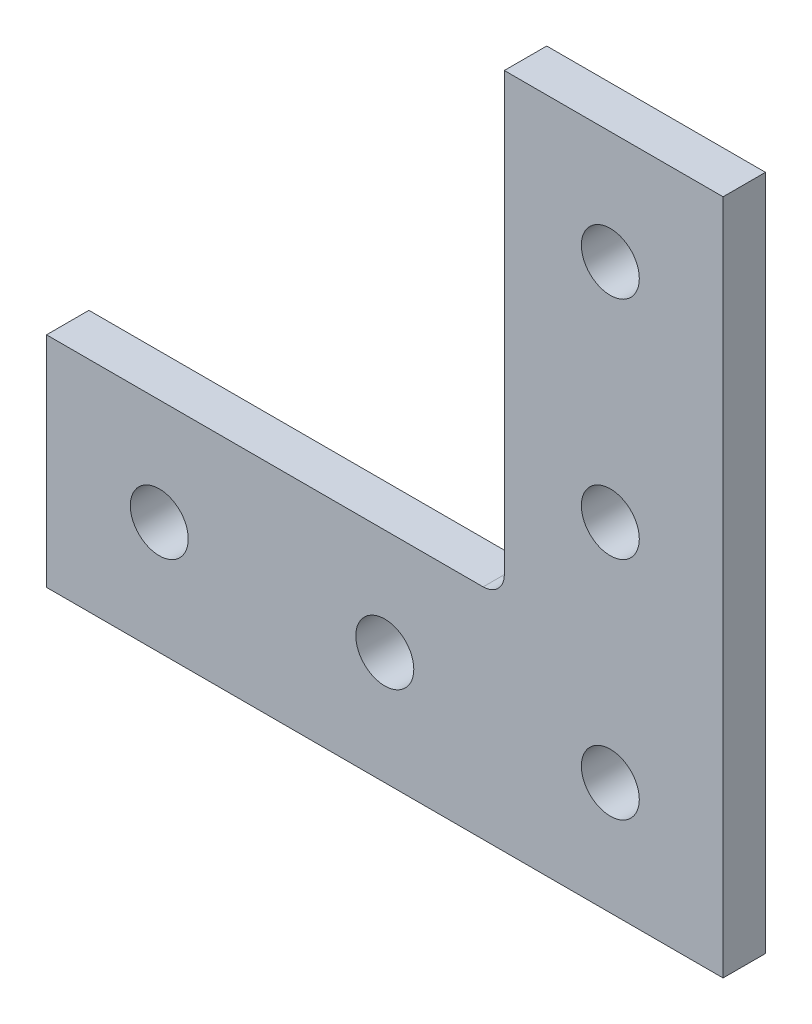
ISO-10303-21;
HEADER;
FILE_DESCRIPTION(('STEP AP214'),'2;1');
FILE_NAME('part.step','',(''),(''),'','','');
FILE_SCHEMA(('AUTOMOTIVE_DESIGN { 1 0 10303 214 1 1 1 1 }'));
ENDSEC;
DATA;
#1=APPLICATION_CONTEXT('core data for automotive mechanical design processes');
#2=APPLICATION_PROTOCOL_DEFINITION('international standard','automotive_design',2000,#1);
#3=PRODUCT_CONTEXT('',#1,'mechanical');
#4=PRODUCT('Part','Part','',(#3));
#5=PRODUCT_RELATED_PRODUCT_CATEGORY('part','',(#4));
#6=PRODUCT_DEFINITION_FORMATION('','',#4);
#7=PRODUCT_DEFINITION_CONTEXT('part definition',#1,'design');
#8=PRODUCT_DEFINITION('design','',#6,#7);
#9=PRODUCT_DEFINITION_SHAPE('','',#8);
#10=(LENGTH_UNIT() NAMED_UNIT(*) SI_UNIT(.MILLI.,.METRE.));
#11=(NAMED_UNIT(*) PLANE_ANGLE_UNIT() SI_UNIT($,.RADIAN.));
#12=(NAMED_UNIT(*) SI_UNIT($,.STERADIAN.) SOLID_ANGLE_UNIT());
#13=UNCERTAINTY_MEASURE_WITH_UNIT(LENGTH_MEASURE(1.E-05),#10,'distance_accuracy_value','');
#14=(GEOMETRIC_REPRESENTATION_CONTEXT(3) GLOBAL_UNCERTAINTY_ASSIGNED_CONTEXT((#13)) GLOBAL_UNIT_ASSIGNED_CONTEXT((#10,
#11,#12)) REPRESENTATION_CONTEXT('',''));
#15=CARTESIAN_POINT('',(0.,0.,0.));
#16=DIRECTION('',(0.,0.,1.));
#17=DIRECTION('',(1.,0.,0.));
#18=AXIS2_PLACEMENT_3D('',#15,#16,#17);
#19=CARTESIAN_POINT('',(-27.0256,27.0256,4.7752));
#20=DIRECTION('',(0.,0.,-1.));
#21=DIRECTION('',(-1.,0.,0.));
#22=AXIS2_PLACEMENT_3D('',#19,#20,#21);
#23=PLANE('',#22);
#24=CARTESIAN_POINT('',(-38.1,12.7,4.7752));
#25=DIRECTION('',(0.,0.,1.));
#26=DIRECTION('',(1.,0.,0.));
#27=AXIS2_PLACEMENT_3D('',#24,#25,#26);
#28=CIRCLE('',#27,3.2639);
#29=CARTESIAN_POINT('',(-34.8361,12.7,4.7752));
#30=VERTEX_POINT('',#29);
#31=EDGE_CURVE('E176',#30,#30,#28,.T.);
#32=ORIENTED_EDGE('',*,*,#31,.F.);
#33=EDGE_LOOP('',(#32));
#34=FACE_BOUND('',#33,.T.);
#35=CARTESIAN_POINT('',(-12.7,63.5,4.7752));
#36=DIRECTION('',(0.,0.,1.));
#37=DIRECTION('',(1.,0.,0.));
#38=AXIS2_PLACEMENT_3D('',#35,#36,#37);
#39=CIRCLE('',#38,3.2639);
#40=CARTESIAN_POINT('',(-9.4361,63.5,4.7752));
#41=VERTEX_POINT('',#40);
#42=EDGE_CURVE('E164',#41,#41,#39,.T.);
#43=ORIENTED_EDGE('',*,*,#42,.F.);
#44=EDGE_LOOP('',(#43));
#45=FACE_BOUND('',#44,.T.);
#46=DIRECTION('',(0.,-1.,0.));
#47=VECTOR('',#46,1.);
#48=CARTESIAN_POINT('',(-76.2,24.638,4.7752));
#49=LINE('',#48,#47);
#50=CARTESIAN_POINT('',(-76.2,24.638,4.7752));
#51=VERTEX_POINT('',#50);
#52=CARTESIAN_POINT('',(-76.2,0.,4.7752));
#53=VERTEX_POINT('',#52);
#54=EDGE_CURVE('E137',#51,#53,#49,.T.);
#55=ORIENTED_EDGE('',*,*,#54,.T.);
#56=DIRECTION('',(1.,0.,0.));
#57=VECTOR('',#56,1.);
#58=CARTESIAN_POINT('',(-76.2,0.,4.7752));
#59=LINE('',#58,#57);
#60=CARTESIAN_POINT('',(0.,0.,4.7752));
#61=VERTEX_POINT('',#60);
#62=EDGE_CURVE('E90',#53,#61,#59,.T.);
#63=ORIENTED_EDGE('',*,*,#62,.T.);
#64=DIRECTION('',(0.,1.,0.));
#65=VECTOR('',#64,1.);
#66=CARTESIAN_POINT('',(0.,0.,4.7752));
#67=LINE('',#66,#65);
#68=CARTESIAN_POINT('',(0.,76.2,4.7752));
#69=VERTEX_POINT('',#68);
#70=EDGE_CURVE('E149',#61,#69,#67,.T.);
#71=ORIENTED_EDGE('',*,*,#70,.T.);
#72=DIRECTION('',(-1.,0.,0.));
#73=VECTOR('',#72,1.);
#74=CARTESIAN_POINT('',(0.,76.2,4.7752));
#75=LINE('',#74,#73);
#76=CARTESIAN_POINT('',(-24.638,76.2,4.7752));
#77=VERTEX_POINT('',#76);
#78=EDGE_CURVE('E106',#69,#77,#75,.T.);
#79=ORIENTED_EDGE('',*,*,#78,.T.);
#80=DIRECTION('',(0.,-1.,0.));
#81=VECTOR('',#80,1.);
#82=CARTESIAN_POINT('',(-24.638,76.2,4.7752));
#83=LINE('',#82,#81);
#84=CARTESIAN_POINT('',(-24.638,27.0256,4.7752));
#85=VERTEX_POINT('',#84);
#86=EDGE_CURVE('E100',#77,#85,#83,.T.);
#87=ORIENTED_EDGE('',*,*,#86,.T.);
#88=CARTESIAN_POINT('',(-27.0256,27.0256,4.7752));
#89=DIRECTION('',(0.,0.,-1.));
#90=DIRECTION('',(-1.,0.,0.));
#91=AXIS2_PLACEMENT_3D('',#88,#89,#90);
#92=CIRCLE('',#91,2.3876);
#93=CARTESIAN_POINT('',(-27.0256,24.638,4.7752));
#94=VERTEX_POINT('',#93);
#95=EDGE_CURVE('E104',#85,#94,#92,.T.);
#96=ORIENTED_EDGE('',*,*,#95,.T.);
#97=DIRECTION('',(-1.,0.,0.));
#98=VECTOR('',#97,1.);
#99=CARTESIAN_POINT('',(-27.0256,24.638,4.7752));
#100=LINE('',#99,#98);
#101=EDGE_CURVE('E50',#94,#51,#100,.T.);
#102=ORIENTED_EDGE('',*,*,#101,.T.);
#103=EDGE_LOOP('',(#55,#63,#71,#79,#87,#96,#102));
#104=FACE_BOUND('',#103,.T.);
#105=CARTESIAN_POINT('',(-12.7,38.1,4.7752));
#106=DIRECTION('',(0.,0.,1.));
#107=DIRECTION('',(1.,0.,0.));
#108=AXIS2_PLACEMENT_3D('',#105,#106,#107);
#109=CIRCLE('',#108,3.2639);
#110=CARTESIAN_POINT('',(-9.4361,38.1,4.7752));
#111=VERTEX_POINT('',#110);
#112=EDGE_CURVE('E128',#111,#111,#109,.T.);
#113=ORIENTED_EDGE('',*,*,#112,.F.);
#114=EDGE_LOOP('',(#113));
#115=FACE_BOUND('',#114,.T.);
#116=CARTESIAN_POINT('',(-12.7,12.7,4.7752));
#117=DIRECTION('',(0.,0.,1.));
#118=DIRECTION('',(1.,0.,0.));
#119=AXIS2_PLACEMENT_3D('',#116,#117,#118);
#120=CIRCLE('',#119,3.2639);
#121=CARTESIAN_POINT('',(-9.4361,12.7,4.7752));
#122=VERTEX_POINT('',#121);
#123=EDGE_CURVE('E170',#122,#122,#120,.T.);
#124=ORIENTED_EDGE('',*,*,#123,.F.);
#125=EDGE_LOOP('',(#124));
#126=FACE_BOUND('',#125,.T.);
#127=CARTESIAN_POINT('',(-63.5,12.7,4.7752));
#128=DIRECTION('',(0.,0.,1.));
#129=DIRECTION('',(1.,0.,0.));
#130=AXIS2_PLACEMENT_3D('',#127,#128,#129);
#131=CIRCLE('',#130,3.2639);
#132=CARTESIAN_POINT('',(-60.2361,12.7,4.7752));
#133=VERTEX_POINT('',#132);
#134=EDGE_CURVE('E182',#133,#133,#131,.T.);
#135=ORIENTED_EDGE('',*,*,#134,.F.);
#136=EDGE_LOOP('',(#135));
#137=FACE_BOUND('',#136,.T.);
#138=ADVANCED_FACE('F33',(#34,#45,#104,#115,#126,#137),#23,.F.);
#139=CARTESIAN_POINT('',(-27.0256,27.0256,0.));
#140=DIRECTION('',(0.,0.,-1.));
#141=DIRECTION('',(-1.,0.,0.));
#142=AXIS2_PLACEMENT_3D('',#139,#140,#141);
#143=PLANE('',#142);
#144=CARTESIAN_POINT('',(-38.1,12.7,0.));
#145=DIRECTION('',(0.,0.,1.));
#146=DIRECTION('',(1.,0.,0.));
#147=AXIS2_PLACEMENT_3D('',#144,#145,#146);
#148=CIRCLE('',#147,3.2639);
#149=CARTESIAN_POINT('',(-34.8361,12.7,0.));
#150=VERTEX_POINT('',#149);
#151=EDGE_CURVE('E179',#150,#150,#148,.T.);
#152=ORIENTED_EDGE('',*,*,#151,.T.);
#153=EDGE_LOOP('',(#152));
#154=FACE_BOUND('',#153,.T.);
#155=CARTESIAN_POINT('',(-12.7,63.5,0.));
#156=DIRECTION('',(0.,0.,1.));
#157=DIRECTION('',(1.,0.,0.));
#158=AXIS2_PLACEMENT_3D('',#155,#156,#157);
#159=CIRCLE('',#158,3.2639);
#160=CARTESIAN_POINT('',(-9.4361,63.5,0.));
#161=VERTEX_POINT('',#160);
#162=EDGE_CURVE('E167',#161,#161,#159,.T.);
#163=ORIENTED_EDGE('',*,*,#162,.T.);
#164=EDGE_LOOP('',(#163));
#165=FACE_BOUND('',#164,.T.);
#166=DIRECTION('',(0.,-1.,0.));
#167=VECTOR('',#166,1.);
#168=CARTESIAN_POINT('',(-76.2,24.638,0.));
#169=LINE('',#168,#167);
#170=CARTESIAN_POINT('',(-76.2,24.638,0.));
#171=VERTEX_POINT('',#170);
#172=CARTESIAN_POINT('',(-76.2,0.,0.));
#173=VERTEX_POINT('',#172);
#174=EDGE_CURVE('E124',#171,#173,#169,.T.);
#175=ORIENTED_EDGE('',*,*,#174,.F.);
#176=DIRECTION('',(-1.,0.,0.));
#177=VECTOR('',#176,1.);
#178=CARTESIAN_POINT('',(-27.0256,24.638,0.));
#179=LINE('',#178,#177);
#180=CARTESIAN_POINT('',(-27.0256,24.638,0.));
#181=VERTEX_POINT('',#180);
#182=EDGE_CURVE('E82',#181,#171,#179,.T.);
#183=ORIENTED_EDGE('',*,*,#182,.F.);
#184=CARTESIAN_POINT('',(-27.0256,27.0256,0.));
#185=DIRECTION('',(0.,0.,-1.));
#186=DIRECTION('',(-1.,0.,0.));
#187=AXIS2_PLACEMENT_3D('',#184,#185,#186);
#188=CIRCLE('',#187,2.3876);
#189=CARTESIAN_POINT('',(-24.638,27.0256,0.));
#190=VERTEX_POINT('',#189);
#191=EDGE_CURVE('E76',#190,#181,#188,.T.);
#192=ORIENTED_EDGE('',*,*,#191,.F.);
#193=DIRECTION('',(0.,-1.,0.));
#194=VECTOR('',#193,1.);
#195=CARTESIAN_POINT('',(-24.638,76.2,0.));
#196=LINE('',#195,#194);
#197=CARTESIAN_POINT('',(-24.638,76.2,0.));
#198=VERTEX_POINT('',#197);
#199=EDGE_CURVE('E114',#198,#190,#196,.T.);
#200=ORIENTED_EDGE('',*,*,#199,.F.);
#201=DIRECTION('',(-1.,0.,0.));
#202=VECTOR('',#201,1.);
#203=CARTESIAN_POINT('',(0.,76.2,0.));
#204=LINE('',#203,#202);
#205=CARTESIAN_POINT('',(0.,76.2,0.));
#206=VERTEX_POINT('',#205);
#207=EDGE_CURVE('E132',#206,#198,#204,.T.);
#208=ORIENTED_EDGE('',*,*,#207,.F.);
#209=DIRECTION('',(0.,1.,0.));
#210=VECTOR('',#209,1.);
#211=CARTESIAN_POINT('',(0.,0.,0.));
#212=LINE('',#211,#210);
#213=CARTESIAN_POINT('',(0.,0.,0.));
#214=VERTEX_POINT('',#213);
#215=EDGE_CURVE('E130',#214,#206,#212,.T.);
#216=ORIENTED_EDGE('',*,*,#215,.F.);
#217=DIRECTION('',(1.,0.,0.));
#218=VECTOR('',#217,1.);
#219=CARTESIAN_POINT('',(-76.2,0.,0.));
#220=LINE('',#219,#218);
#221=EDGE_CURVE('E127',#173,#214,#220,.T.);
#222=ORIENTED_EDGE('',*,*,#221,.F.);
#223=EDGE_LOOP('',(#175,#183,#192,#200,#208,#216,#222));
#224=FACE_BOUND('',#223,.T.);
#225=CARTESIAN_POINT('',(-12.7,38.1,0.));
#226=DIRECTION('',(0.,0.,1.));
#227=DIRECTION('',(1.,0.,0.));
#228=AXIS2_PLACEMENT_3D('',#225,#226,#227);
#229=CIRCLE('',#228,3.2639);
#230=CARTESIAN_POINT('',(-9.4361,38.1,0.));
#231=VERTEX_POINT('',#230);
#232=EDGE_CURVE('E161',#231,#231,#229,.T.);
#233=ORIENTED_EDGE('',*,*,#232,.T.);
#234=EDGE_LOOP('',(#233));
#235=FACE_BOUND('',#234,.T.);
#236=CARTESIAN_POINT('',(-12.7,12.7,0.));
#237=DIRECTION('',(0.,0.,1.));
#238=DIRECTION('',(1.,0.,0.));
#239=AXIS2_PLACEMENT_3D('',#236,#237,#238);
#240=CIRCLE('',#239,3.2639);
#241=CARTESIAN_POINT('',(-9.4361,12.7,0.));
#242=VERTEX_POINT('',#241);
#243=EDGE_CURVE('E173',#242,#242,#240,.T.);
#244=ORIENTED_EDGE('',*,*,#243,.T.);
#245=EDGE_LOOP('',(#244));
#246=FACE_BOUND('',#245,.T.);
#247=CARTESIAN_POINT('',(-63.5,12.7,0.));
#248=DIRECTION('',(0.,0.,1.));
#249=DIRECTION('',(1.,0.,0.));
#250=AXIS2_PLACEMENT_3D('',#247,#248,#249);
#251=CIRCLE('',#250,3.2639);
#252=CARTESIAN_POINT('',(-60.2361,12.7,0.));
#253=VERTEX_POINT('',#252);
#254=EDGE_CURVE('E185',#253,#253,#251,.T.);
#255=ORIENTED_EDGE('',*,*,#254,.T.);
#256=EDGE_LOOP('',(#255));
#257=FACE_BOUND('',#256,.T.);
#258=ADVANCED_FACE('F153',(#154,#165,#224,#235,#246,#257),#143,.T.);
#259=CARTESIAN_POINT('',(-76.2,24.638,4.7752));
#260=DIRECTION('',(1.,0.,0.));
#261=DIRECTION('',(0.,0.,-1.));
#262=AXIS2_PLACEMENT_3D('',#259,#260,#261);
#263=PLANE('',#262);
#264=ORIENTED_EDGE('',*,*,#174,.T.);
#265=DIRECTION('',(0.,0.,-1.));
#266=VECTOR('',#265,1.);
#267=CARTESIAN_POINT('',(-76.2,0.,4.7752));
#268=LINE('',#267,#266);
#269=EDGE_CURVE('E11',#53,#173,#268,.T.);
#270=ORIENTED_EDGE('',*,*,#269,.F.);
#271=ORIENTED_EDGE('',*,*,#54,.F.);
#272=DIRECTION('',(0.,0.,-1.));
#273=VECTOR('',#272,1.);
#274=CARTESIAN_POINT('',(-76.2,24.638,4.7752));
#275=LINE('',#274,#273);
#276=EDGE_CURVE('E120',#51,#171,#275,.T.);
#277=ORIENTED_EDGE('',*,*,#276,.T.);
#278=EDGE_LOOP('',(#264,#270,#271,#277));
#279=FACE_BOUND('',#278,.T.);
#280=ADVANCED_FACE('F35',(#279),#263,.F.);
#281=CARTESIAN_POINT('',(-76.2,0.,4.7752));
#282=DIRECTION('',(0.,1.,0.));
#283=DIRECTION('',(0.,0.,1.));
#284=AXIS2_PLACEMENT_3D('',#281,#282,#283);
#285=PLANE('',#284);
#286=ORIENTED_EDGE('',*,*,#221,.T.);
#287=DIRECTION('',(0.,0.,-1.));
#288=VECTOR('',#287,1.);
#289=CARTESIAN_POINT('',(0.,0.,4.7752));
#290=LINE('',#289,#288);
#291=EDGE_CURVE('E42',#61,#214,#290,.T.);
#292=ORIENTED_EDGE('',*,*,#291,.F.);
#293=ORIENTED_EDGE('',*,*,#62,.F.);
#294=ORIENTED_EDGE('',*,*,#269,.T.);
#295=EDGE_LOOP('',(#286,#292,#293,#294));
#296=FACE_BOUND('',#295,.T.);
#297=ADVANCED_FACE('F218',(#296),#285,.F.);
#298=CARTESIAN_POINT('',(0.,0.,4.7752));
#299=DIRECTION('',(-1.,0.,0.));
#300=DIRECTION('',(0.,0.,1.));
#301=AXIS2_PLACEMENT_3D('',#298,#299,#300);
#302=PLANE('',#301);
#303=ORIENTED_EDGE('',*,*,#215,.T.);
#304=DIRECTION('',(0.,0.,-1.));
#305=VECTOR('',#304,1.);
#306=CARTESIAN_POINT('',(0.,76.2,4.7752));
#307=LINE('',#306,#305);
#308=EDGE_CURVE('E141',#69,#206,#307,.T.);
#309=ORIENTED_EDGE('',*,*,#308,.F.);
#310=ORIENTED_EDGE('',*,*,#70,.F.);
#311=ORIENTED_EDGE('',*,*,#291,.T.);
#312=EDGE_LOOP('',(#303,#309,#310,#311));
#313=FACE_BOUND('',#312,.T.);
#314=ADVANCED_FACE('F147',(#313),#302,.F.);
#315=CARTESIAN_POINT('',(0.,76.2,4.7752));
#316=DIRECTION('',(0.,-1.,0.));
#317=DIRECTION('',(0.,0.,-1.));
#318=AXIS2_PLACEMENT_3D('',#315,#316,#317);
#319=PLANE('',#318);
#320=ORIENTED_EDGE('',*,*,#207,.T.);
#321=DIRECTION('',(0.,0.,-1.));
#322=VECTOR('',#321,1.);
#323=CARTESIAN_POINT('',(-24.638,76.2,4.7752));
#324=LINE('',#323,#322);
#325=EDGE_CURVE('E115',#77,#198,#324,.T.);
#326=ORIENTED_EDGE('',*,*,#325,.F.);
#327=ORIENTED_EDGE('',*,*,#78,.F.);
#328=ORIENTED_EDGE('',*,*,#308,.T.);
#329=EDGE_LOOP('',(#320,#326,#327,#328));
#330=FACE_BOUND('',#329,.T.);
#331=ADVANCED_FACE('F156',(#330),#319,.F.);
#332=CARTESIAN_POINT('',(-24.638,76.2,4.7752));
#333=DIRECTION('',(1.,0.,0.));
#334=DIRECTION('',(0.,0.,-1.));
#335=AXIS2_PLACEMENT_3D('',#332,#333,#334);
#336=PLANE('',#335);
#337=ORIENTED_EDGE('',*,*,#199,.T.);
#338=DIRECTION('',(0.,0.,-1.));
#339=VECTOR('',#338,1.);
#340=CARTESIAN_POINT('',(-24.638,27.0256,4.7752));
#341=LINE('',#340,#339);
#342=EDGE_CURVE('E111',#85,#190,#341,.T.);
#343=ORIENTED_EDGE('',*,*,#342,.F.);
#344=ORIENTED_EDGE('',*,*,#86,.F.);
#345=ORIENTED_EDGE('',*,*,#325,.T.);
#346=EDGE_LOOP('',(#337,#343,#344,#345));
#347=FACE_BOUND('',#346,.T.);
#348=ADVANCED_FACE('F112',(#347),#336,.F.);
#349=CARTESIAN_POINT('',(-27.0256,27.0256,4.7752));
#350=DIRECTION('',(0.,0.,-1.));
#351=DIRECTION('',(-1.,0.,0.));
#352=AXIS2_PLACEMENT_3D('',#349,#350,#351);
#353=CYLINDRICAL_SURFACE('',#352,2.3876);
#354=ORIENTED_EDGE('',*,*,#191,.T.);
#355=DIRECTION('',(0.,0.,-1.));
#356=VECTOR('',#355,1.);
#357=CARTESIAN_POINT('',(-27.0256,24.638,4.7752));
#358=LINE('',#357,#356);
#359=EDGE_CURVE('E116',#94,#181,#358,.T.);
#360=ORIENTED_EDGE('',*,*,#359,.F.);
#361=ORIENTED_EDGE('',*,*,#95,.F.);
#362=ORIENTED_EDGE('',*,*,#342,.T.);
#363=EDGE_LOOP('',(#354,#360,#361,#362));
#364=FACE_BOUND('',#363,.T.);
#365=ADVANCED_FACE('F118',(#364),#353,.F.);
#366=CARTESIAN_POINT('',(-27.0256,24.638,4.7752));
#367=DIRECTION('',(0.,-1.,0.));
#368=DIRECTION('',(0.,0.,-1.));
#369=AXIS2_PLACEMENT_3D('',#366,#367,#368);
#370=PLANE('',#369);
#371=ORIENTED_EDGE('',*,*,#182,.T.);
#372=ORIENTED_EDGE('',*,*,#276,.F.);
#373=ORIENTED_EDGE('',*,*,#101,.F.);
#374=ORIENTED_EDGE('',*,*,#359,.T.);
#375=EDGE_LOOP('',(#371,#372,#373,#374));
#376=FACE_BOUND('',#375,.T.);
#377=ADVANCED_FACE('F208',(#376),#370,.F.);
#378=CARTESIAN_POINT('',(-12.7,38.1,4.7752));
#379=DIRECTION('',(0.,0.,-1.));
#380=DIRECTION('',(-1.,0.,0.));
#381=AXIS2_PLACEMENT_3D('',#378,#379,#380);
#382=CYLINDRICAL_SURFACE('',#381,3.2639);
#383=ORIENTED_EDGE('',*,*,#112,.T.);
#384=EDGE_LOOP('',(#383));
#385=FACE_BOUND('',#384,.T.);
#386=ORIENTED_EDGE('',*,*,#232,.F.);
#387=EDGE_LOOP('',(#386));
#388=FACE_BOUND('',#387,.T.);
#389=ADVANCED_FACE('F205',(#385,#388),#382,.F.);
#390=CARTESIAN_POINT('',(-12.7,63.5,4.7752));
#391=DIRECTION('',(0.,0.,-1.));
#392=DIRECTION('',(-1.,0.,0.));
#393=AXIS2_PLACEMENT_3D('',#390,#391,#392);
#394=CYLINDRICAL_SURFACE('',#393,3.2639);
#395=ORIENTED_EDGE('',*,*,#42,.T.);
#396=EDGE_LOOP('',(#395));
#397=FACE_BOUND('',#396,.T.);
#398=ORIENTED_EDGE('',*,*,#162,.F.);
#399=EDGE_LOOP('',(#398));
#400=FACE_BOUND('',#399,.T.);
#401=ADVANCED_FACE('F277',(#397,#400),#394,.F.);
#402=CARTESIAN_POINT('',(-12.7,12.7,4.7752));
#403=DIRECTION('',(0.,0.,-1.));
#404=DIRECTION('',(-1.,0.,0.));
#405=AXIS2_PLACEMENT_3D('',#402,#403,#404);
#406=CYLINDRICAL_SURFACE('',#405,3.2639);
#407=ORIENTED_EDGE('',*,*,#123,.T.);
#408=EDGE_LOOP('',(#407));
#409=FACE_BOUND('',#408,.T.);
#410=ORIENTED_EDGE('',*,*,#243,.F.);
#411=EDGE_LOOP('',(#410));
#412=FACE_BOUND('',#411,.T.);
#413=ADVANCED_FACE('F285',(#409,#412),#406,.F.);
#414=CARTESIAN_POINT('',(-38.1,12.7,4.7752));
#415=DIRECTION('',(0.,0.,-1.));
#416=DIRECTION('',(-1.,0.,0.));
#417=AXIS2_PLACEMENT_3D('',#414,#415,#416);
#418=CYLINDRICAL_SURFACE('',#417,3.2639);
#419=ORIENTED_EDGE('',*,*,#31,.T.);
#420=EDGE_LOOP('',(#419));
#421=FACE_BOUND('',#420,.T.);
#422=ORIENTED_EDGE('',*,*,#151,.F.);
#423=EDGE_LOOP('',(#422));
#424=FACE_BOUND('',#423,.T.);
#425=ADVANCED_FACE('F293',(#421,#424),#418,.F.);
#426=CARTESIAN_POINT('',(-63.5,12.7,4.7752));
#427=DIRECTION('',(0.,0.,-1.));
#428=DIRECTION('',(-1.,0.,0.));
#429=AXIS2_PLACEMENT_3D('',#426,#427,#428);
#430=CYLINDRICAL_SURFACE('',#429,3.2639);
#431=ORIENTED_EDGE('',*,*,#134,.T.);
#432=EDGE_LOOP('',(#431));
#433=FACE_BOUND('',#432,.T.);
#434=ORIENTED_EDGE('',*,*,#254,.F.);
#435=EDGE_LOOP('',(#434));
#436=FACE_BOUND('',#435,.T.);
#437=ADVANCED_FACE('F191',(#433,#436),#430,.F.);
#438=CLOSED_SHELL('',(#138,#258,#280,#297,#314,#331,#348,#365,#377,#389,#401,#413,#425,#437));
#439=MANIFOLD_SOLID_BREP('B2',#438);
#440=ADVANCED_BREP_SHAPE_REPRESENTATION('',(#18,#439),#14);
#441=SHAPE_DEFINITION_REPRESENTATION(#9,#440);
ENDSEC;
END-ISO-10303-21;
